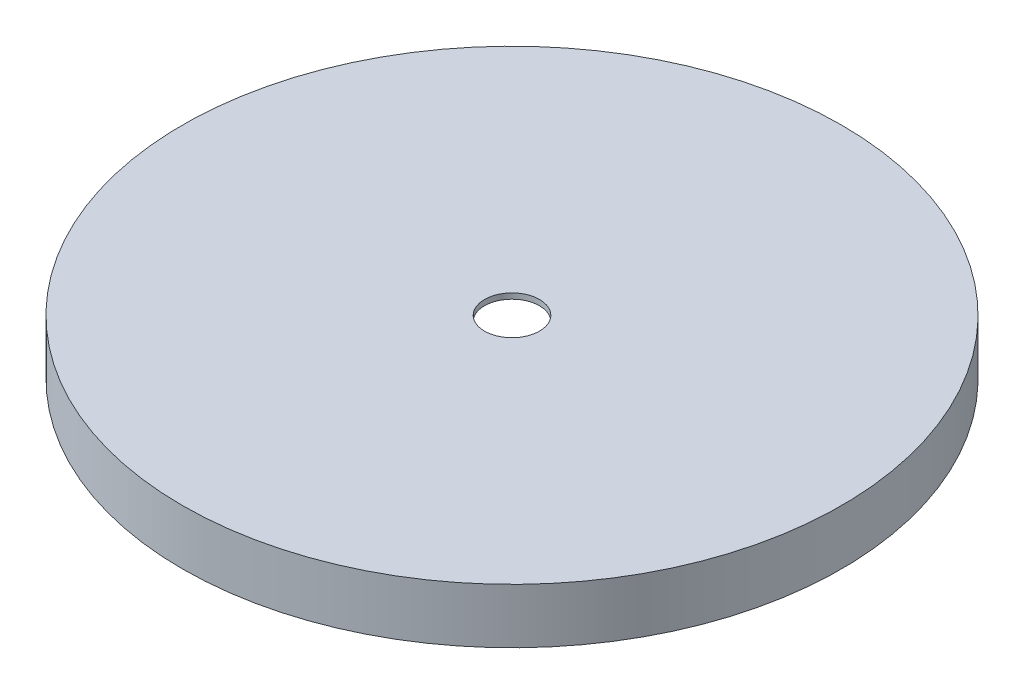
ISO-10303-21;
HEADER;
FILE_DESCRIPTION(('STEP AP214'),'2;1');
FILE_NAME('part.step','',(''),(''),'','','');
FILE_SCHEMA(('AUTOMOTIVE_DESIGN { 1 0 10303 214 1 1 1 1 }'));
ENDSEC;
DATA;
#1=APPLICATION_CONTEXT('core data for automotive mechanical design processes');
#2=APPLICATION_PROTOCOL_DEFINITION('international standard','automotive_design',2000,#1);
#3=PRODUCT_CONTEXT('',#1,'mechanical');
#4=PRODUCT('Part','Part','',(#3));
#5=PRODUCT_RELATED_PRODUCT_CATEGORY('part','',(#4));
#6=PRODUCT_DEFINITION_FORMATION('','',#4);
#7=PRODUCT_DEFINITION_CONTEXT('part definition',#1,'design');
#8=PRODUCT_DEFINITION('design','',#6,#7);
#9=PRODUCT_DEFINITION_SHAPE('','',#8);
#10=(LENGTH_UNIT() NAMED_UNIT(*) SI_UNIT(.MILLI.,.METRE.));
#11=(NAMED_UNIT(*) PLANE_ANGLE_UNIT() SI_UNIT($,.RADIAN.));
#12=(NAMED_UNIT(*) SI_UNIT($,.STERADIAN.) SOLID_ANGLE_UNIT());
#13=UNCERTAINTY_MEASURE_WITH_UNIT(LENGTH_MEASURE(1.E-05),#10,'distance_accuracy_value','');
#14=(GEOMETRIC_REPRESENTATION_CONTEXT(3) GLOBAL_UNCERTAINTY_ASSIGNED_CONTEXT((#13)) GLOBAL_UNIT_ASSIGNED_CONTEXT((#10,
#11,#12)) REPRESENTATION_CONTEXT('',''));
#15=CARTESIAN_POINT('',(0.,0.,0.));
#16=DIRECTION('',(0.,0.,1.));
#17=DIRECTION('',(1.,0.,0.));
#18=AXIS2_PLACEMENT_3D('',#15,#16,#17);
#19=CARTESIAN_POINT('',(152.4,0.,0.));
#20=DIRECTION('',(0.,-1.,0.));
#21=DIRECTION('',(0.,0.,-1.));
#22=AXIS2_PLACEMENT_3D('',#19,#20,#21);
#23=PLANE('',#22);
#24=CARTESIAN_POINT('',(0.,0.,0.));
#25=DIRECTION('',(0.,-1.,0.));
#26=DIRECTION('',(0.,0.,-1.));
#27=AXIS2_PLACEMENT_3D('',#24,#25,#26);
#28=CIRCLE('',#27,149.86);
#29=CARTESIAN_POINT('',(0.,0.,-149.86));
#30=VERTEX_POINT('',#29);
#31=EDGE_CURVE('E45',#30,#30,#28,.T.);
#32=ORIENTED_EDGE('',*,*,#31,.F.);
#33=EDGE_LOOP('',(#32));
#34=FACE_BOUND('',#33,.T.);
#35=CARTESIAN_POINT('',(0.,0.,0.));
#36=DIRECTION('',(0.,-1.,0.));
#37=DIRECTION('',(0.,0.,-1.));
#38=AXIS2_PLACEMENT_3D('',#35,#36,#37);
#39=CIRCLE('',#38,152.4);
#40=CARTESIAN_POINT('',(0.,0.,-152.4));
#41=VERTEX_POINT('',#40);
#42=EDGE_CURVE('E38',#41,#41,#39,.T.);
#43=ORIENTED_EDGE('',*,*,#42,.T.);
#44=EDGE_LOOP('',(#43));
#45=FACE_BOUND('',#44,.T.);
#46=ADVANCED_FACE('F31',(#34,#45),#23,.T.);
#47=CARTESIAN_POINT('',(0.,25.4,0.));
#48=DIRECTION('',(0.,1.,0.));
#49=DIRECTION('',(0.,0.,1.));
#50=AXIS2_PLACEMENT_3D('',#47,#48,#49);
#51=PLANE('',#50);
#52=CARTESIAN_POINT('',(0.,25.4,0.));
#53=DIRECTION('',(0.,1.,0.));
#54=DIRECTION('',(0.,0.,1.));
#55=AXIS2_PLACEMENT_3D('',#52,#53,#54);
#56=CIRCLE('',#55,12.7);
#57=CARTESIAN_POINT('',(0.,25.4,12.7));
#58=VERTEX_POINT('',#57);
#59=EDGE_CURVE('E50',#58,#58,#56,.T.);
#60=ORIENTED_EDGE('',*,*,#59,.F.);
#61=EDGE_LOOP('',(#60));
#62=FACE_BOUND('',#61,.T.);
#63=CARTESIAN_POINT('',(0.,25.4,0.));
#64=DIRECTION('',(0.,-1.,0.));
#65=DIRECTION('',(0.,0.,-1.));
#66=AXIS2_PLACEMENT_3D('',#63,#64,#65);
#67=CIRCLE('',#66,152.4);
#68=CARTESIAN_POINT('',(0.,25.4,-152.4));
#69=VERTEX_POINT('',#68);
#70=EDGE_CURVE('E10',#69,#69,#67,.T.);
#71=ORIENTED_EDGE('',*,*,#70,.F.);
#72=EDGE_LOOP('',(#71));
#73=FACE_BOUND('',#72,.T.);
#74=ADVANCED_FACE('F71',(#62,#73),#51,.T.);
#75=CARTESIAN_POINT('',(0.,0.,0.));
#76=DIRECTION('',(0.,-1.,0.));
#77=DIRECTION('',(0.,0.,-1.));
#78=AXIS2_PLACEMENT_3D('',#75,#76,#77);
#79=CYLINDRICAL_SURFACE('',#78,152.4);
#80=ORIENTED_EDGE('',*,*,#70,.T.);
#81=EDGE_LOOP('',(#80));
#82=FACE_BOUND('',#81,.T.);
#83=ORIENTED_EDGE('',*,*,#42,.F.);
#84=EDGE_LOOP('',(#83));
#85=FACE_BOUND('',#84,.T.);
#86=ADVANCED_FACE('F76',(#82,#85),#79,.T.);
#87=CARTESIAN_POINT('',(0.,22.86,0.));
#88=DIRECTION('',(0.,1.,0.));
#89=DIRECTION('',(0.,0.,1.));
#90=AXIS2_PLACEMENT_3D('',#87,#88,#89);
#91=PLANE('',#90);
#92=CARTESIAN_POINT('',(0.,22.86,0.));
#93=DIRECTION('',(0.,1.,0.));
#94=DIRECTION('',(0.,0.,1.));
#95=AXIS2_PLACEMENT_3D('',#92,#93,#94);
#96=CIRCLE('',#95,12.7);
#97=CARTESIAN_POINT('',(0.,22.86,12.7));
#98=VERTEX_POINT('',#97);
#99=EDGE_CURVE('E34',#98,#98,#96,.T.);
#100=ORIENTED_EDGE('',*,*,#99,.T.);
#101=EDGE_LOOP('',(#100));
#102=FACE_BOUND('',#101,.T.);
#103=CARTESIAN_POINT('',(0.,22.86,0.));
#104=DIRECTION('',(0.,1.,0.));
#105=DIRECTION('',(0.,0.,1.));
#106=AXIS2_PLACEMENT_3D('',#103,#104,#105);
#107=CIRCLE('',#106,149.86);
#108=CARTESIAN_POINT('',(0.,22.86,149.86));
#109=VERTEX_POINT('',#108);
#110=EDGE_CURVE('E42',#109,#109,#107,.F.);
#111=ORIENTED_EDGE('',*,*,#110,.T.);
#112=EDGE_LOOP('',(#111));
#113=FACE_BOUND('',#112,.T.);
#114=ADVANCED_FACE('F57',(#102,#113),#91,.F.);
#115=CARTESIAN_POINT('',(0.,0.,0.));
#116=DIRECTION('',(0.,-1.,0.));
#117=DIRECTION('',(0.,0.,-1.));
#118=AXIS2_PLACEMENT_3D('',#115,#116,#117);
#119=CYLINDRICAL_SURFACE('',#118,149.86);
#120=ORIENTED_EDGE('',*,*,#110,.F.);
#121=EDGE_LOOP('',(#120));
#122=FACE_BOUND('',#121,.T.);
#123=ORIENTED_EDGE('',*,*,#31,.T.);
#124=EDGE_LOOP('',(#123));
#125=FACE_BOUND('',#124,.T.);
#126=ADVANCED_FACE('F62',(#122,#125),#119,.F.);
#127=CARTESIAN_POINT('',(0.,0.,0.));
#128=DIRECTION('',(0.,1.,0.));
#129=DIRECTION('',(0.,0.,1.));
#130=AXIS2_PLACEMENT_3D('',#127,#128,#129);
#131=CYLINDRICAL_SURFACE('',#130,12.7);
#132=CARTESIAN_POINT('',(0.,25.4,12.7));
#133=CARTESIAN_POINT('',(0.,25.3735416666667,12.7));
#134=CARTESIAN_POINT('',(0.,25.3470833333333,12.7));
#135=CARTESIAN_POINT('',(0.,25.2941666666667,12.7));
#136=CARTESIAN_POINT('',(0.,25.2677083333333,12.7));
#137=CARTESIAN_POINT('',(0.,25.2147916666667,12.7));
#138=CARTESIAN_POINT('',(0.,25.1883333333333,12.7));
#139=CARTESIAN_POINT('',(0.,25.1354166666667,12.7));
#140=CARTESIAN_POINT('',(0.,25.1089583333333,12.7));
#141=CARTESIAN_POINT('',(0.,25.0560416666667,12.7));
#142=CARTESIAN_POINT('',(0.,25.0295833333333,12.7));
#143=CARTESIAN_POINT('',(0.,24.9766666666667,12.7));
#144=CARTESIAN_POINT('',(0.,24.9502083333333,12.7));
#145=CARTESIAN_POINT('',(0.,24.8972916666667,12.7));
#146=CARTESIAN_POINT('',(0.,24.8708333333333,12.7));
#147=CARTESIAN_POINT('',(0.,24.8179166666667,12.7));
#148=CARTESIAN_POINT('',(0.,24.7914583333333,12.7));
#149=CARTESIAN_POINT('',(0.,24.7385416666667,12.7));
#150=CARTESIAN_POINT('',(0.,24.7120833333333,12.7));
#151=CARTESIAN_POINT('',(0.,24.6591666666667,12.7));
#152=CARTESIAN_POINT('',(0.,24.6327083333333,12.7));
#153=CARTESIAN_POINT('',(0.,24.5797916666667,12.7));
#154=CARTESIAN_POINT('',(0.,24.5533333333333,12.7));
#155=CARTESIAN_POINT('',(0.,24.5004166666667,12.7));
#156=CARTESIAN_POINT('',(0.,24.4739583333333,12.7));
#157=CARTESIAN_POINT('',(0.,24.4210416666667,12.7));
#158=CARTESIAN_POINT('',(0.,24.3945833333333,12.7));
#159=CARTESIAN_POINT('',(0.,24.3416666666667,12.7));
#160=CARTESIAN_POINT('',(0.,24.3152083333333,12.7));
#161=CARTESIAN_POINT('',(0.,24.2622916666667,12.7));
#162=CARTESIAN_POINT('',(0.,24.2358333333333,12.7));
#163=CARTESIAN_POINT('',(0.,24.1829166666667,12.7));
#164=CARTESIAN_POINT('',(0.,24.1564583333333,12.7));
#165=CARTESIAN_POINT('',(0.,24.1035416666667,12.7));
#166=CARTESIAN_POINT('',(0.,24.0770833333333,12.7));
#167=CARTESIAN_POINT('',(0.,24.0241666666667,12.7));
#168=CARTESIAN_POINT('',(0.,23.9977083333333,12.7));
#169=CARTESIAN_POINT('',(0.,23.9447916666667,12.7));
#170=CARTESIAN_POINT('',(0.,23.9183333333333,12.7));
#171=CARTESIAN_POINT('',(0.,23.8654166666667,12.7));
#172=CARTESIAN_POINT('',(0.,23.8389583333333,12.7));
#173=CARTESIAN_POINT('',(0.,23.7860416666667,12.7));
#174=CARTESIAN_POINT('',(0.,23.7595833333333,12.7));
#175=CARTESIAN_POINT('',(0.,23.7066666666667,12.7));
#176=CARTESIAN_POINT('',(0.,23.6802083333333,12.7));
#177=CARTESIAN_POINT('',(0.,23.6272916666667,12.7));
#178=CARTESIAN_POINT('',(0.,23.6008333333333,12.7));
#179=CARTESIAN_POINT('',(0.,23.5479166666667,12.7));
#180=CARTESIAN_POINT('',(0.,23.5214583333333,12.7));
#181=CARTESIAN_POINT('',(0.,23.4685416666667,12.7));
#182=CARTESIAN_POINT('',(0.,23.4420833333333,12.7));
#183=CARTESIAN_POINT('',(0.,23.3891666666667,12.7));
#184=CARTESIAN_POINT('',(0.,23.3627083333333,12.7));
#185=CARTESIAN_POINT('',(0.,23.3097916666667,12.7));
#186=CARTESIAN_POINT('',(0.,23.2833333333333,12.7));
#187=CARTESIAN_POINT('',(0.,23.2304166666667,12.7));
#188=CARTESIAN_POINT('',(0.,23.2039583333333,12.7));
#189=CARTESIAN_POINT('',(0.,23.1510416666667,12.7));
#190=CARTESIAN_POINT('',(0.,23.1245833333333,12.7));
#191=CARTESIAN_POINT('',(0.,23.0716666666667,12.7));
#192=CARTESIAN_POINT('',(0.,23.0452083333333,12.7));
#193=CARTESIAN_POINT('',(0.,22.9922916666667,12.7));
#194=CARTESIAN_POINT('',(0.,22.9658333333333,12.7));
#195=CARTESIAN_POINT('',(0.,22.9129166666667,12.7));
#196=CARTESIAN_POINT('',(0.,22.8864583333333,12.7));
#197=CARTESIAN_POINT('',(0.,22.86,12.7));
#198=B_SPLINE_CURVE_WITH_KNOTS('',3,(#132,#133,#134,#135,#136,#137,#138,#139,#140,#141,#142,
#143,#144,#145,#146,#147,#148,#149,#150,#151,#152,#153,#154,#155,#156,#157,#158,#159,#160,#161,
#162,#163,#164,#165,#166,#167,#168,#169,#170,#171,#172,#173,#174,#175,#176,#177,#178,#179,#180,
#181,#182,#183,#184,#185,#186,#187,#188,#189,#190,#191,#192,#193,#194,#195,#196,#197),
.UNSPECIFIED.,.F.,.F.,(4,2,2,2,2,2,2,2,2,2,2,2,2,2,2,2,2,2,2,2,2,2,2,2,2,2,2,2,2,2,2,2,4),(0.,
0.0793749999999996,0.158749999999999,0.238124999999999,0.317499999999998,0.396875000000001,
0.476250000000001,0.555625000000001,0.635,0.714375,0.793749999999999,0.873124999999999,
0.952500000000002,1.031875,1.11125,1.190625,1.27,1.349375,1.42875,1.508125,1.5875,1.666875,
1.74625,1.825625,1.905,1.984375,2.06375,2.143125,2.2225,2.301875,2.38125,2.460625,2.54),.UNSPECIFIED.);
#199=EDGE_CURVE('BSEAM60',#58,#98,#198,.T.);
#200=ORIENTED_EDGE('',*,*,#59,.T.);
#201=ORIENTED_EDGE('',*,*,#99,.F.);
#202=ORIENTED_EDGE('',*,*,#199,.T.);
#203=ORIENTED_EDGE('',*,*,#199,.F.);
#204=EDGE_LOOP('',(#200,#202,#201,#203));
#205=FACE_BOUND('',#204,.T.);
#206=ADVANCED_FACE('F60',(#205),#131,.F.);
#207=CLOSED_SHELL('',(#46,#74,#86,#114,#126,#206));
#208=MANIFOLD_SOLID_BREP('B2',#207);
#209=ADVANCED_BREP_SHAPE_REPRESENTATION('',(#18,#208),#14);
#210=SHAPE_DEFINITION_REPRESENTATION(#9,#209);
ENDSEC;
END-ISO-10303-21;
